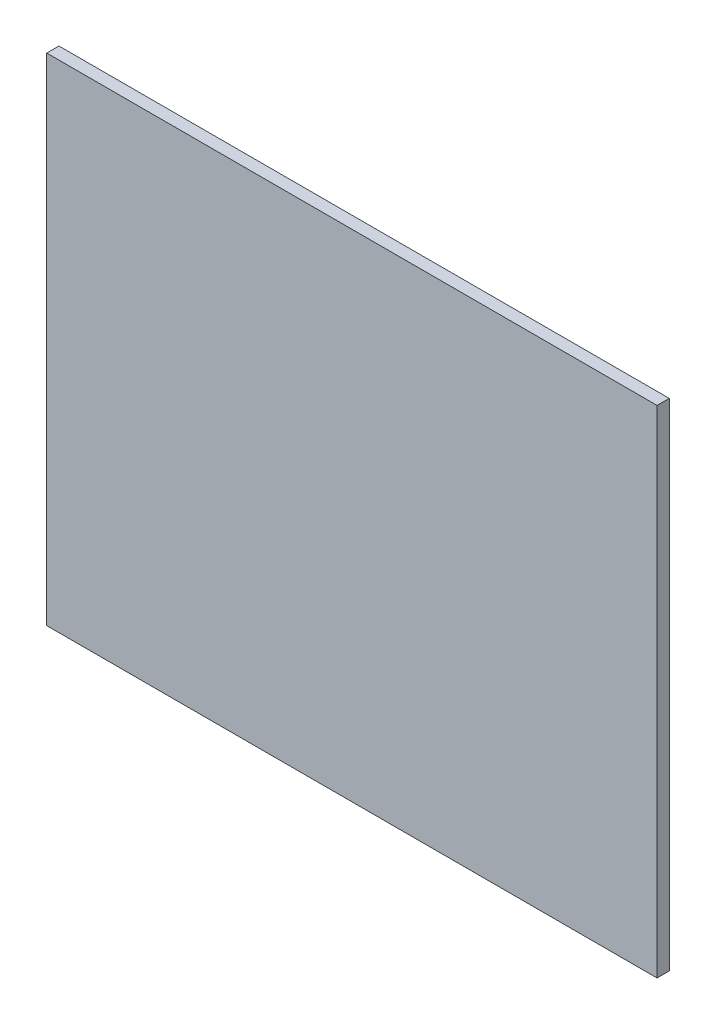
ISO-10303-21;
HEADER;
FILE_DESCRIPTION(('STEP AP214'),'2;1');
FILE_NAME('part.step','',(''),(''),'','','');
FILE_SCHEMA(('AUTOMOTIVE_DESIGN { 1 0 10303 214 1 1 1 1 }'));
ENDSEC;
DATA;
#1=APPLICATION_CONTEXT('core data for automotive mechanical design processes');
#2=APPLICATION_PROTOCOL_DEFINITION('international standard','automotive_design',2000,#1);
#3=PRODUCT_CONTEXT('',#1,'mechanical');
#4=PRODUCT('Part','Part','',(#3));
#5=PRODUCT_RELATED_PRODUCT_CATEGORY('part','',(#4));
#6=PRODUCT_DEFINITION_FORMATION('','',#4);
#7=PRODUCT_DEFINITION_CONTEXT('part definition',#1,'design');
#8=PRODUCT_DEFINITION('design','',#6,#7);
#9=PRODUCT_DEFINITION_SHAPE('','',#8);
#10=(LENGTH_UNIT() NAMED_UNIT(*) SI_UNIT(.MILLI.,.METRE.));
#11=(NAMED_UNIT(*) PLANE_ANGLE_UNIT() SI_UNIT($,.RADIAN.));
#12=(NAMED_UNIT(*) SI_UNIT($,.STERADIAN.) SOLID_ANGLE_UNIT());
#13=UNCERTAINTY_MEASURE_WITH_UNIT(LENGTH_MEASURE(1.E-05),#10,'distance_accuracy_value','');
#14=(GEOMETRIC_REPRESENTATION_CONTEXT(3) GLOBAL_UNCERTAINTY_ASSIGNED_CONTEXT((#13)) GLOBAL_UNIT_ASSIGNED_CONTEXT((#10,
#11,#12)) REPRESENTATION_CONTEXT('',''));
#15=CARTESIAN_POINT('',(0.,0.,0.));
#16=DIRECTION('',(0.,0.,1.));
#17=DIRECTION('',(1.,0.,0.));
#18=AXIS2_PLACEMENT_3D('',#15,#16,#17);
#19=CARTESIAN_POINT('',(4.24999999999999,70.,1.6));
#20=DIRECTION('',(1.,0.,0.));
#21=DIRECTION('',(0.,1.,0.));
#22=AXIS2_PLACEMENT_3D('',#19,#20,#21);
#23=PLANE('',#22);
#24=DIRECTION('',(0.,-1.,0.));
#25=VECTOR('',#24,1.);
#26=CARTESIAN_POINT('',(4.24999999999999,70.,0.));
#27=LINE('',#26,#25);
#28=CARTESIAN_POINT('',(4.24999999999999,70.,0.));
#29=VERTEX_POINT('',#28);
#30=CARTESIAN_POINT('',(4.25,5.,0.));
#31=VERTEX_POINT('',#30);
#32=EDGE_CURVE('E100',#29,#31,#27,.T.);
#33=ORIENTED_EDGE('',*,*,#32,.T.);
#34=DIRECTION('',(0.,0.,-1.));
#35=VECTOR('',#34,1.);
#36=CARTESIAN_POINT('',(4.25,5.,1.6));
#37=LINE('',#36,#35);
#38=CARTESIAN_POINT('',(4.25,5.,1.6));
#39=VERTEX_POINT('',#38);
#40=EDGE_CURVE('E11',#39,#31,#37,.T.);
#41=ORIENTED_EDGE('',*,*,#40,.F.);
#42=DIRECTION('',(0.,-1.,0.));
#43=VECTOR('',#42,1.);
#44=CARTESIAN_POINT('',(4.24999999999999,70.,1.6));
#45=LINE('',#44,#43);
#46=CARTESIAN_POINT('',(4.24999999999999,70.,1.6));
#47=VERTEX_POINT('',#46);
#48=EDGE_CURVE('E88',#47,#39,#45,.T.);
#49=ORIENTED_EDGE('',*,*,#48,.F.);
#50=DIRECTION('',(0.,0.,-1.));
#51=VECTOR('',#50,1.);
#52=CARTESIAN_POINT('',(4.24999999999999,70.,1.6));
#53=LINE('',#52,#51);
#54=EDGE_CURVE('E96',#47,#29,#53,.T.);
#55=ORIENTED_EDGE('',*,*,#54,.T.);
#56=EDGE_LOOP('',(#33,#41,#49,#55));
#57=FACE_BOUND('',#56,.T.);
#58=ADVANCED_FACE('F37',(#57),#23,.F.);
#59=CARTESIAN_POINT('',(4.25,5.,1.6));
#60=DIRECTION('',(0.,1.,0.));
#61=DIRECTION('',(0.,0.,1.));
#62=AXIS2_PLACEMENT_3D('',#59,#60,#61);
#63=PLANE('',#62);
#64=DIRECTION('',(1.,0.,0.));
#65=VECTOR('',#64,1.);
#66=CARTESIAN_POINT('',(4.25,5.,0.));
#67=LINE('',#66,#65);
#68=CARTESIAN_POINT('',(84.25,5.,0.));
#69=VERTEX_POINT('',#68);
#70=EDGE_CURVE('E92',#31,#69,#67,.T.);
#71=ORIENTED_EDGE('',*,*,#70,.T.);
#72=DIRECTION('',(0.,0.,-1.));
#73=VECTOR('',#72,1.);
#74=CARTESIAN_POINT('',(84.25,5.,1.6));
#75=LINE('',#74,#73);
#76=CARTESIAN_POINT('',(84.25,5.,1.6));
#77=VERTEX_POINT('',#76);
#78=EDGE_CURVE('E45',#77,#69,#75,.T.);
#79=ORIENTED_EDGE('',*,*,#78,.F.);
#80=DIRECTION('',(1.,0.,0.));
#81=VECTOR('',#80,1.);
#82=CARTESIAN_POINT('',(4.25,5.,1.6));
#83=LINE('',#82,#81);
#84=EDGE_CURVE('E83',#39,#77,#83,.T.);
#85=ORIENTED_EDGE('',*,*,#84,.F.);
#86=ORIENTED_EDGE('',*,*,#40,.T.);
#87=EDGE_LOOP('',(#71,#79,#85,#86));
#88=FACE_BOUND('',#87,.T.);
#89=ADVANCED_FACE('F91',(#88),#63,.F.);
#90=CARTESIAN_POINT('',(84.25,70.,1.6));
#91=DIRECTION('',(-1.,0.,0.));
#92=DIRECTION('',(0.,-1.,0.));
#93=AXIS2_PLACEMENT_3D('',#90,#91,#92);
#94=PLANE('',#93);
#95=DIRECTION('',(0.,1.,0.));
#96=VECTOR('',#95,1.);
#97=CARTESIAN_POINT('',(84.25,70.,0.));
#98=LINE('',#97,#96);
#99=CARTESIAN_POINT('',(84.25,70.,0.));
#100=VERTEX_POINT('',#99);
#101=EDGE_CURVE('E70',#69,#100,#98,.T.);
#102=ORIENTED_EDGE('',*,*,#101,.T.);
#103=DIRECTION('',(0.,0.,-1.));
#104=VECTOR('',#103,1.);
#105=CARTESIAN_POINT('',(84.25,70.,1.6));
#106=LINE('',#105,#104);
#107=CARTESIAN_POINT('',(84.25,70.,1.6));
#108=VERTEX_POINT('',#107);
#109=EDGE_CURVE('E93',#108,#100,#106,.T.);
#110=ORIENTED_EDGE('',*,*,#109,.F.);
#111=DIRECTION('',(0.,1.,0.));
#112=VECTOR('',#111,1.);
#113=CARTESIAN_POINT('',(84.25,70.,1.6));
#114=LINE('',#113,#112);
#115=EDGE_CURVE('E86',#77,#108,#114,.T.);
#116=ORIENTED_EDGE('',*,*,#115,.F.);
#117=ORIENTED_EDGE('',*,*,#78,.T.);
#118=EDGE_LOOP('',(#102,#110,#116,#117));
#119=FACE_BOUND('',#118,.T.);
#120=ADVANCED_FACE('F94',(#119),#94,.F.);
#121=CARTESIAN_POINT('',(4.24999999999999,70.,1.6));
#122=DIRECTION('',(0.,-1.,0.));
#123=DIRECTION('',(0.,0.,-1.));
#124=AXIS2_PLACEMENT_3D('',#121,#122,#123);
#125=PLANE('',#124);
#126=DIRECTION('',(-1.,0.,0.));
#127=VECTOR('',#126,1.);
#128=CARTESIAN_POINT('',(4.24999999999999,70.,0.));
#129=LINE('',#128,#127);
#130=EDGE_CURVE('E76',#100,#29,#129,.T.);
#131=ORIENTED_EDGE('',*,*,#130,.T.);
#132=ORIENTED_EDGE('',*,*,#54,.F.);
#133=DIRECTION('',(-1.,0.,0.));
#134=VECTOR('',#133,1.);
#135=CARTESIAN_POINT('',(4.24999999999999,70.,1.6));
#136=LINE('',#135,#134);
#137=EDGE_CURVE('E53',#108,#47,#136,.T.);
#138=ORIENTED_EDGE('',*,*,#137,.F.);
#139=ORIENTED_EDGE('',*,*,#109,.T.);
#140=EDGE_LOOP('',(#131,#132,#138,#139));
#141=FACE_BOUND('',#140,.T.);
#142=ADVANCED_FACE('F108',(#141),#125,.F.);
#143=CARTESIAN_POINT('',(0.,0.,1.6));
#144=DIRECTION('',(0.,0.,1.));
#145=DIRECTION('',(1.,0.,0.));
#146=AXIS2_PLACEMENT_3D('',#143,#144,#145);
#147=PLANE('',#146);
#148=ORIENTED_EDGE('',*,*,#48,.T.);
#149=ORIENTED_EDGE('',*,*,#84,.T.);
#150=ORIENTED_EDGE('',*,*,#115,.T.);
#151=ORIENTED_EDGE('',*,*,#137,.T.);
#152=EDGE_LOOP('',(#148,#149,#150,#151));
#153=FACE_BOUND('',#152,.T.);
#154=ADVANCED_FACE('F84',(#153),#147,.T.);
#155=CARTESIAN_POINT('',(0.,0.,0.));
#156=DIRECTION('',(0.,0.,1.));
#157=DIRECTION('',(1.,0.,0.));
#158=AXIS2_PLACEMENT_3D('',#155,#156,#157);
#159=PLANE('',#158);
#160=ORIENTED_EDGE('',*,*,#32,.F.);
#161=ORIENTED_EDGE('',*,*,#130,.F.);
#162=ORIENTED_EDGE('',*,*,#101,.F.);
#163=ORIENTED_EDGE('',*,*,#70,.F.);
#164=EDGE_LOOP('',(#160,#161,#162,#163));
#165=FACE_BOUND('',#164,.T.);
#166=ADVANCED_FACE('F111',(#165),#159,.F.);
#167=CLOSED_SHELL('',(#58,#89,#120,#142,#154,#166));
#168=MANIFOLD_SOLID_BREP('B2',#167);
#169=ADVANCED_BREP_SHAPE_REPRESENTATION('',(#18,#168),#14);
#170=SHAPE_DEFINITION_REPRESENTATION(#9,#169);
ENDSEC;
END-ISO-10303-21;
